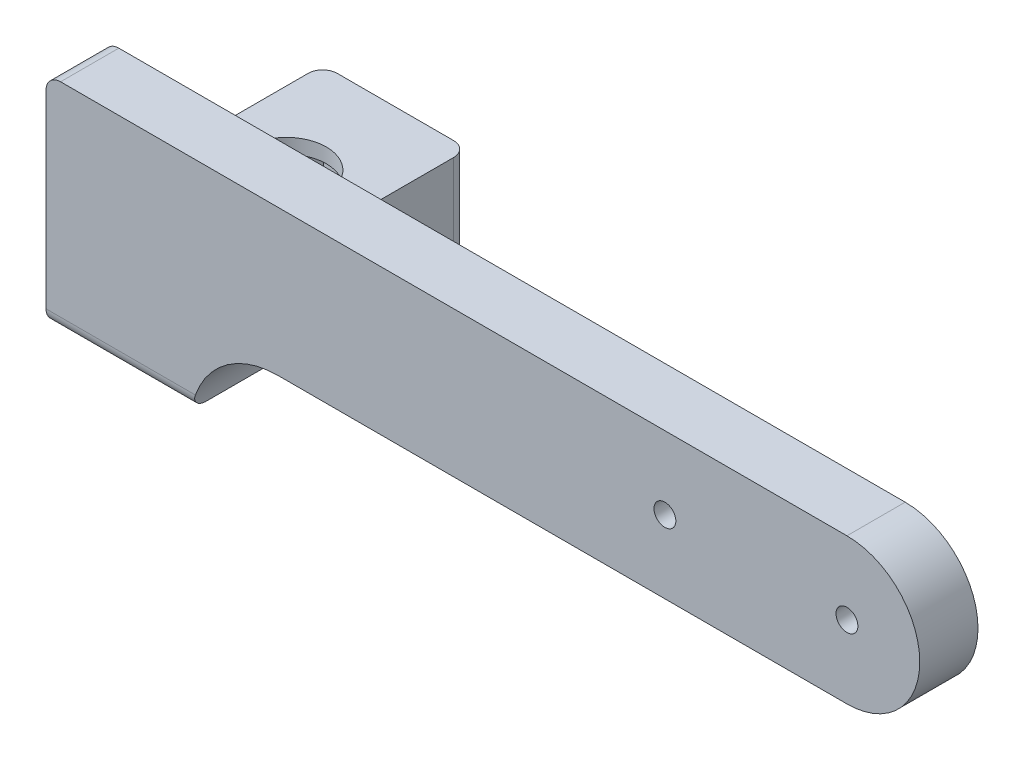
ISO-10303-21;
HEADER;
FILE_DESCRIPTION(('STEP AP214'),'2;1');
FILE_NAME('part.step','',(''),(''),'','','');
FILE_SCHEMA(('AUTOMOTIVE_DESIGN { 1 0 10303 214 1 1 1 1 }'));
ENDSEC;
DATA;
#1=APPLICATION_CONTEXT('core data for automotive mechanical design processes');
#2=APPLICATION_PROTOCOL_DEFINITION('international standard','automotive_design',2000,#1);
#3=PRODUCT_CONTEXT('',#1,'mechanical');
#4=PRODUCT('Part','Part','',(#3));
#5=PRODUCT_RELATED_PRODUCT_CATEGORY('part','',(#4));
#6=PRODUCT_DEFINITION_FORMATION('','',#4);
#7=PRODUCT_DEFINITION_CONTEXT('part definition',#1,'design');
#8=PRODUCT_DEFINITION('design','',#6,#7);
#9=PRODUCT_DEFINITION_SHAPE('','',#8);
#10=(LENGTH_UNIT() NAMED_UNIT(*) SI_UNIT(.MILLI.,.METRE.));
#11=(NAMED_UNIT(*) PLANE_ANGLE_UNIT() SI_UNIT($,.RADIAN.));
#12=(NAMED_UNIT(*) SI_UNIT($,.STERADIAN.) SOLID_ANGLE_UNIT());
#13=UNCERTAINTY_MEASURE_WITH_UNIT(LENGTH_MEASURE(1.E-05),#10,'distance_accuracy_value','');
#14=(GEOMETRIC_REPRESENTATION_CONTEXT(3) GLOBAL_UNCERTAINTY_ASSIGNED_CONTEXT((#13)) GLOBAL_UNIT_ASSIGNED_CONTEXT((#10,
#11,#12)) REPRESENTATION_CONTEXT('',''));
#15=CARTESIAN_POINT('',(0.,0.,0.));
#16=DIRECTION('',(0.,0.,1.));
#17=DIRECTION('',(1.,0.,0.));
#18=AXIS2_PLACEMENT_3D('',#15,#16,#17);
#19=CARTESIAN_POINT('',(85.,0.,0.));
#20=DIRECTION('',(0.,0.,1.));
#21=DIRECTION('',(1.,0.,0.));
#22=AXIS2_PLACEMENT_3D('',#19,#20,#21);
#23=PLANE('',#22);
#24=CARTESIAN_POINT('',(59.9999999999999,0.,0.));
#25=DIRECTION('',(0.,0.,1.));
#26=DIRECTION('',(1.,0.,0.));
#27=AXIS2_PLACEMENT_3D('',#24,#25,#26);
#28=CIRCLE('',#27,1.50000000000001);
#29=CARTESIAN_POINT('',(61.5,0.,0.));
#30=VERTEX_POINT('',#29);
#31=EDGE_CURVE('E441',#30,#30,#28,.T.);
#32=ORIENTED_EDGE('',*,*,#31,.T.);
#33=EDGE_LOOP('',(#32));
#34=FACE_BOUND('',#33,.T.);
#35=CARTESIAN_POINT('',(85.,0.,0.));
#36=DIRECTION('',(0.,0.,1.));
#37=DIRECTION('',(1.,0.,0.));
#38=AXIS2_PLACEMENT_3D('',#35,#36,#37);
#39=CIRCLE('',#38,1.5);
#40=CARTESIAN_POINT('',(86.5,0.,0.));
#41=VERTEX_POINT('',#40);
#42=EDGE_CURVE('E251',#41,#41,#39,.T.);
#43=ORIENTED_EDGE('',*,*,#42,.T.);
#44=EDGE_LOOP('',(#43));
#45=FACE_BOUND('',#44,.T.);
#46=DIRECTION('',(0.,-1.,0.));
#47=VECTOR('',#46,1.);
#48=CARTESIAN_POINT('',(-25.,10.,0.));
#49=LINE('',#48,#47);
#50=CARTESIAN_POINT('',(-25.,8.,0.));
#51=VERTEX_POINT('',#50);
#52=CARTESIAN_POINT('',(-25.,-3.,0.));
#53=VERTEX_POINT('',#52);
#54=EDGE_CURVE('E264',#51,#53,#49,.T.);
#55=ORIENTED_EDGE('',*,*,#54,.F.);
#56=CARTESIAN_POINT('',(-23.,8.,0.));
#57=DIRECTION('',(0.,0.,1.));
#58=DIRECTION('',(1.,0.,0.));
#59=AXIS2_PLACEMENT_3D('',#56,#57,#58);
#60=CIRCLE('',#59,2.);
#61=CARTESIAN_POINT('',(-23.,10.,0.));
#62=VERTEX_POINT('',#61);
#63=EDGE_CURVE('E336',#51,#62,#60,.F.);
#64=ORIENTED_EDGE('',*,*,#63,.T.);
#65=DIRECTION('',(-1.,0.,0.));
#66=VECTOR('',#65,1.);
#67=CARTESIAN_POINT('',(-25.,10.,0.));
#68=LINE('',#67,#66);
#69=CARTESIAN_POINT('',(85.,10.,0.));
#70=VERTEX_POINT('',#69);
#71=EDGE_CURVE('E256',#70,#62,#68,.T.);
#72=ORIENTED_EDGE('',*,*,#71,.F.);
#73=CARTESIAN_POINT('',(85.,0.,0.));
#74=DIRECTION('',(0.,0.,1.));
#75=DIRECTION('',(1.,0.,0.));
#76=AXIS2_PLACEMENT_3D('',#73,#74,#75);
#77=CIRCLE('',#76,10.);
#78=CARTESIAN_POINT('',(85.,-10.,0.));
#79=VERTEX_POINT('',#78);
#80=EDGE_CURVE('E268',#79,#70,#77,.T.);
#81=ORIENTED_EDGE('',*,*,#80,.F.);
#82=DIRECTION('',(1.,0.,0.));
#83=VECTOR('',#82,1.);
#84=CARTESIAN_POINT('',(-25.,-10.,0.));
#85=LINE('',#84,#83);
#86=CARTESIAN_POINT('',(6.83215956619923,-10.,0.));
#87=VERTEX_POINT('',#86);
#88=EDGE_CURVE('E266',#87,#79,#85,.T.);
#89=ORIENTED_EDGE('',*,*,#88,.F.);
#90=CARTESIAN_POINT('',(6.83215956619924,-22.,0.));
#91=DIRECTION('',(0.,0.,1.));
#92=DIRECTION('',(1.,0.,0.));
#93=AXIS2_PLACEMENT_3D('',#90,#91,#92);
#94=CIRCLE('',#93,12.);
#95=CARTESIAN_POINT('',(0.,-12.1348291620473,0.));
#96=VERTEX_POINT('',#95);
#97=EDGE_CURVE('E282',#87,#96,#94,.T.);
#98=ORIENTED_EDGE('',*,*,#97,.T.);
#99=DIRECTION('',(0.,-1.,0.));
#100=VECTOR('',#99,1.);
#101=CARTESIAN_POINT('',(0.,0.,0.));
#102=LINE('',#101,#100);
#103=CARTESIAN_POINT('',(0.,-3.,0.));
#104=VERTEX_POINT('',#103);
#105=EDGE_CURVE('E295',#96,#104,#102,.F.);
#106=ORIENTED_EDGE('',*,*,#105,.T.);
#107=DIRECTION('',(1.,0.,0.));
#108=VECTOR('',#107,1.);
#109=CARTESIAN_POINT('',(-25.,-3.,0.));
#110=LINE('',#109,#108);
#111=EDGE_CURVE('E292',#104,#53,#110,.F.);
#112=ORIENTED_EDGE('',*,*,#111,.T.);
#113=EDGE_LOOP('',(#55,#64,#72,#81,#89,#98,#106,#112));
#114=FACE_BOUND('',#113,.T.);
#115=ADVANCED_FACE('F32',(#34,#45,#114),#23,.F.);
#116=CARTESIAN_POINT('',(-25.,10.,8.));
#117=DIRECTION('',(1.,0.,0.));
#118=DIRECTION('',(0.,1.,0.));
#119=AXIS2_PLACEMENT_3D('',#116,#117,#118);
#120=PLANE('',#119);
#121=DIRECTION('',(0.,0.,-1.));
#122=VECTOR('',#121,1.);
#123=CARTESIAN_POINT('',(-25.,-20.,8.));
#124=LINE('',#123,#122);
#125=CARTESIAN_POINT('',(-25.,-20.,6.));
#126=VERTEX_POINT('',#125);
#127=CARTESIAN_POINT('',(-25.,-20.,-28.));
#128=VERTEX_POINT('',#127);
#129=EDGE_CURVE('E243',#126,#128,#124,.T.);
#130=ORIENTED_EDGE('',*,*,#129,.F.);
#131=CARTESIAN_POINT('',(-25.,-18.,6.));
#132=DIRECTION('',(1.,0.,0.));
#133=DIRECTION('',(0.,1.,0.));
#134=AXIS2_PLACEMENT_3D('',#131,#132,#133);
#135=CIRCLE('',#134,2.);
#136=CARTESIAN_POINT('',(-25.,-18.,8.));
#137=VERTEX_POINT('',#136);
#138=EDGE_CURVE('E364',#126,#137,#135,.F.);
#139=ORIENTED_EDGE('',*,*,#138,.T.);
#140=DIRECTION('',(0.,-1.,0.));
#141=VECTOR('',#140,1.);
#142=CARTESIAN_POINT('',(-25.,10.,8.));
#143=LINE('',#142,#141);
#144=CARTESIAN_POINT('',(-25.,8.,8.));
#145=VERTEX_POINT('',#144);
#146=EDGE_CURVE('E252',#145,#137,#143,.T.);
#147=ORIENTED_EDGE('',*,*,#146,.F.);
#148=DIRECTION('',(0.,0.,-1.));
#149=VECTOR('',#148,1.);
#150=CARTESIAN_POINT('',(-25.,8.,8.));
#151=LINE('',#150,#149);
#152=EDGE_CURVE('E360',#145,#51,#151,.T.);
#153=ORIENTED_EDGE('',*,*,#152,.T.);
#154=ORIENTED_EDGE('',*,*,#54,.T.);
#155=CARTESIAN_POINT('',(-25.,-3.,-5.));
#156=DIRECTION('',(1.,0.,0.));
#157=DIRECTION('',(0.,1.,0.));
#158=AXIS2_PLACEMENT_3D('',#155,#156,#157);
#159=CIRCLE('',#158,5.);
#160=CARTESIAN_POINT('',(-25.,-8.,-5.));
#161=VERTEX_POINT('',#160);
#162=EDGE_CURVE('E307',#53,#161,#159,.T.);
#163=ORIENTED_EDGE('',*,*,#162,.T.);
#164=DIRECTION('',(0.,0.,1.));
#165=VECTOR('',#164,1.);
#166=CARTESIAN_POINT('',(-25.,-8.,-30.));
#167=LINE('',#166,#165);
#168=CARTESIAN_POINT('',(-25.,-8.,-28.));
#169=VERTEX_POINT('',#168);
#170=EDGE_CURVE('E237',#169,#161,#167,.T.);
#171=ORIENTED_EDGE('',*,*,#170,.F.);
#172=DIRECTION('',(0.,1.,0.));
#173=VECTOR('',#172,1.);
#174=CARTESIAN_POINT('',(-25.,10.,-28.));
#175=LINE('',#174,#173);
#176=EDGE_CURVE('E355',#169,#128,#175,.F.);
#177=ORIENTED_EDGE('',*,*,#176,.T.);
#178=EDGE_LOOP('',(#130,#139,#147,#153,#154,#163,#171,#177));
#179=FACE_BOUND('',#178,.T.);
#180=ADVANCED_FACE('F354',(#179),#120,.F.);
#181=CARTESIAN_POINT('',(-25.,-10.,8.));
#182=DIRECTION('',(0.,1.,0.));
#183=DIRECTION('',(0.,0.,1.));
#184=AXIS2_PLACEMENT_3D('',#181,#182,#183);
#185=PLANE('',#184);
#186=DIRECTION('',(1.,0.,0.));
#187=VECTOR('',#186,1.);
#188=CARTESIAN_POINT('',(-25.,-10.,8.));
#189=LINE('',#188,#187);
#190=CARTESIAN_POINT('',(6.83215956619923,-10.,8.));
#191=VERTEX_POINT('',#190);
#192=CARTESIAN_POINT('',(85.,-10.,8.));
#193=VERTEX_POINT('',#192);
#194=EDGE_CURVE('E255',#191,#193,#189,.T.);
#195=ORIENTED_EDGE('',*,*,#194,.F.);
#196=DIRECTION('',(0.,0.,-1.));
#197=VECTOR('',#196,1.);
#198=CARTESIAN_POINT('',(6.83215956619923,-10.,8.));
#199=LINE('',#198,#197);
#200=EDGE_CURVE('E277',#191,#87,#199,.T.);
#201=ORIENTED_EDGE('',*,*,#200,.T.);
#202=ORIENTED_EDGE('',*,*,#88,.T.);
#203=DIRECTION('',(0.,0.,-1.));
#204=VECTOR('',#203,1.);
#205=CARTESIAN_POINT('',(85.,-10.,8.));
#206=LINE('',#205,#204);
#207=EDGE_CURVE('E274',#193,#79,#206,.T.);
#208=ORIENTED_EDGE('',*,*,#207,.F.);
#209=EDGE_LOOP('',(#195,#201,#202,#208));
#210=FACE_BOUND('',#209,.T.);
#211=ADVANCED_FACE('F405',(#210),#185,.F.);
#212=CARTESIAN_POINT('',(85.,0.,8.));
#213=DIRECTION('',(0.,0.,-1.));
#214=DIRECTION('',(-1.,0.,0.));
#215=AXIS2_PLACEMENT_3D('',#212,#213,#214);
#216=CYLINDRICAL_SURFACE('',#215,10.);
#217=ORIENTED_EDGE('',*,*,#80,.T.);
#218=DIRECTION('',(0.,0.,-1.));
#219=VECTOR('',#218,1.);
#220=CARTESIAN_POINT('',(85.,10.,8.));
#221=LINE('',#220,#219);
#222=CARTESIAN_POINT('',(85.,10.,8.));
#223=VERTEX_POINT('',#222);
#224=EDGE_CURVE('E263',#223,#70,#221,.T.);
#225=ORIENTED_EDGE('',*,*,#224,.F.);
#226=CARTESIAN_POINT('',(85.,0.,8.));
#227=DIRECTION('',(0.,0.,1.));
#228=DIRECTION('',(1.,0.,0.));
#229=AXIS2_PLACEMENT_3D('',#226,#227,#228);
#230=CIRCLE('',#229,10.);
#231=EDGE_CURVE('E258',#193,#223,#230,.T.);
#232=ORIENTED_EDGE('',*,*,#231,.F.);
#233=ORIENTED_EDGE('',*,*,#207,.T.);
#234=EDGE_LOOP('',(#217,#225,#232,#233));
#235=FACE_BOUND('',#234,.T.);
#236=ADVANCED_FACE('F400',(#235),#216,.T.);
#237=CARTESIAN_POINT('',(-25.,10.,8.));
#238=DIRECTION('',(0.,-1.,0.));
#239=DIRECTION('',(0.,0.,-1.));
#240=AXIS2_PLACEMENT_3D('',#237,#238,#239);
#241=PLANE('',#240);
#242=ORIENTED_EDGE('',*,*,#71,.T.);
#243=DIRECTION('',(0.,0.,-1.));
#244=VECTOR('',#243,1.);
#245=CARTESIAN_POINT('',(-23.,10.,8.));
#246=LINE('',#245,#244);
#247=CARTESIAN_POINT('',(-23.,10.,8.));
#248=VERTEX_POINT('',#247);
#249=EDGE_CURVE('E340',#62,#248,#246,.F.);
#250=ORIENTED_EDGE('',*,*,#249,.T.);
#251=DIRECTION('',(-1.,0.,0.));
#252=VECTOR('',#251,1.);
#253=CARTESIAN_POINT('',(-25.,10.,8.));
#254=LINE('',#253,#252);
#255=EDGE_CURVE('E260',#223,#248,#254,.T.);
#256=ORIENTED_EDGE('',*,*,#255,.F.);
#257=ORIENTED_EDGE('',*,*,#224,.T.);
#258=EDGE_LOOP('',(#242,#250,#256,#257));
#259=FACE_BOUND('',#258,.T.);
#260=ADVANCED_FACE('F395',(#259),#241,.F.);
#261=CARTESIAN_POINT('',(85.,0.,8.));
#262=DIRECTION('',(0.,0.,1.));
#263=DIRECTION('',(1.,0.,0.));
#264=AXIS2_PLACEMENT_3D('',#261,#262,#263);
#265=PLANE('',#264);
#266=CARTESIAN_POINT('',(59.9999999999999,0.,8.));
#267=DIRECTION('',(0.,0.,1.));
#268=DIRECTION('',(1.,0.,0.));
#269=AXIS2_PLACEMENT_3D('',#266,#267,#268);
#270=CIRCLE('',#269,1.50000000000001);
#271=CARTESIAN_POINT('',(61.5,0.,8.));
#272=VERTEX_POINT('',#271);
#273=EDGE_CURVE('E436',#272,#272,#270,.T.);
#274=ORIENTED_EDGE('',*,*,#273,.F.);
#275=EDGE_LOOP('',(#274));
#276=FACE_BOUND('',#275,.T.);
#277=CARTESIAN_POINT('',(85.,0.,8.));
#278=DIRECTION('',(0.,0.,1.));
#279=DIRECTION('',(1.,0.,0.));
#280=AXIS2_PLACEMENT_3D('',#277,#278,#279);
#281=CIRCLE('',#280,1.5);
#282=CARTESIAN_POINT('',(86.5,0.,8.));
#283=VERTEX_POINT('',#282);
#284=EDGE_CURVE('E246',#283,#283,#281,.T.);
#285=ORIENTED_EDGE('',*,*,#284,.F.);
#286=EDGE_LOOP('',(#285));
#287=FACE_BOUND('',#286,.T.);
#288=ORIENTED_EDGE('',*,*,#146,.T.);
#289=DIRECTION('',(-1.,0.,0.));
#290=VECTOR('',#289,1.);
#291=CARTESIAN_POINT('',(85.,-18.,8.));
#292=LINE('',#291,#290);
#293=CARTESIAN_POINT('',(-4.48154893278553,-18.,8.));
#294=VERTEX_POINT('',#293);
#295=EDGE_CURVE('E337',#137,#294,#292,.F.);
#296=ORIENTED_EDGE('',*,*,#295,.T.);
#297=CARTESIAN_POINT('',(6.83215956619924,-22.,8.));
#298=DIRECTION('',(0.,0.,1.));
#299=DIRECTION('',(1.,0.,0.));
#300=AXIS2_PLACEMENT_3D('',#297,#298,#299);
#301=CIRCLE('',#300,12.);
#302=EDGE_CURVE('E285',#294,#191,#301,.F.);
#303=ORIENTED_EDGE('',*,*,#302,.T.);
#304=ORIENTED_EDGE('',*,*,#194,.T.);
#305=ORIENTED_EDGE('',*,*,#231,.T.);
#306=ORIENTED_EDGE('',*,*,#255,.T.);
#307=CARTESIAN_POINT('',(-23.,8.,8.));
#308=DIRECTION('',(0.,0.,1.));
#309=DIRECTION('',(1.,0.,0.));
#310=AXIS2_PLACEMENT_3D('',#307,#308,#309);
#311=CIRCLE('',#310,2.);
#312=EDGE_CURVE('E371',#248,#145,#311,.T.);
#313=ORIENTED_EDGE('',*,*,#312,.T.);
#314=EDGE_LOOP('',(#288,#296,#303,#304,#305,#306,#313));
#315=FACE_BOUND('',#314,.T.);
#316=ADVANCED_FACE('F377',(#276,#287,#315),#265,.T.);
#317=CARTESIAN_POINT('',(85.,0.,-2.));
#318=DIRECTION('',(0.,0.,1.));
#319=DIRECTION('',(1.,0.,0.));
#320=AXIS2_PLACEMENT_3D('',#317,#318,#319);
#321=CYLINDRICAL_SURFACE('',#320,1.5);
#322=ORIENTED_EDGE('',*,*,#284,.T.);
#323=EDGE_LOOP('',(#322));
#324=FACE_BOUND('',#323,.T.);
#325=ORIENTED_EDGE('',*,*,#42,.F.);
#326=EDGE_LOOP('',(#325));
#327=FACE_BOUND('',#326,.T.);
#328=ADVANCED_FACE('F427',(#324,#327),#321,.F.);
#329=CARTESIAN_POINT('',(-25.,-20.,8.));
#330=DIRECTION('',(0.,-1.,0.));
#331=DIRECTION('',(1.,0.,0.));
#332=AXIS2_PLACEMENT_3D('',#329,#330,#331);
#333=PLANE('',#332);
#334=DIRECTION('',(-0.642787609686542,0.,0.766044443118976));
#335=VECTOR('',#334,1.);
#336=CARTESIAN_POINT('',(-6.62913409939624,-20.,-13.5239904898311));
#337=LINE('',#336,#335);
#338=CARTESIAN_POINT('',(-6.62913409939624,-20.,-13.5239904898311));
#339=VERTEX_POINT('',#338);
#340=CARTESIAN_POINT('',(-12.0928287817318,-20.,-7.01261272331977));
#341=VERTEX_POINT('',#340);
#342=EDGE_CURVE('E177',#339,#341,#337,.T.);
#343=ORIENTED_EDGE('',*,*,#342,.F.);
#344=DIRECTION('',(0.342020143325665,0.,0.93969262078591));
#345=VECTOR('',#344,1.);
#346=CARTESIAN_POINT('',(-9.5363053176644,-20.,-21.5113777665113));
#347=LINE('',#346,#345);
#348=CARTESIAN_POINT('',(-9.5363053176644,-20.,-21.5113777665113));
#349=VERTEX_POINT('',#348);
#350=EDGE_CURVE('E195',#349,#339,#347,.T.);
#351=ORIENTED_EDGE('',*,*,#350,.F.);
#352=DIRECTION('',(0.984807753012208,0.,0.173648177666933));
#353=VECTOR('',#352,1.);
#354=CARTESIAN_POINT('',(-17.9071712182682,-20.,-22.9873872766802));
#355=LINE('',#354,#353);
#356=CARTESIAN_POINT('',(-17.9071712182682,-20.,-22.9873872766802));
#357=VERTEX_POINT('',#356);
#358=EDGE_CURVE('E198',#357,#349,#355,.T.);
#359=ORIENTED_EDGE('',*,*,#358,.F.);
#360=DIRECTION('',(0.642787609686542,0.,-0.766044443118976));
#361=VECTOR('',#360,1.);
#362=CARTESIAN_POINT('',(-23.3708659006038,-20.,-16.4760095101689));
#363=LINE('',#362,#361);
#364=CARTESIAN_POINT('',(-23.3708659006038,-20.,-16.4760095101689));
#365=VERTEX_POINT('',#364);
#366=EDGE_CURVE('E218',#365,#357,#363,.T.);
#367=ORIENTED_EDGE('',*,*,#366,.F.);
#368=DIRECTION('',(-0.342020143325665,0.,-0.939692620785909));
#369=VECTOR('',#368,1.);
#370=CARTESIAN_POINT('',(-20.4636946823356,-20.,-8.4886222334887));
#371=LINE('',#370,#369);
#372=CARTESIAN_POINT('',(-20.4636946823356,-20.,-8.4886222334887));
#373=VERTEX_POINT('',#372);
#374=EDGE_CURVE('E215',#373,#365,#371,.T.);
#375=ORIENTED_EDGE('',*,*,#374,.F.);
#376=DIRECTION('',(-0.984807753012207,0.,-0.173648177666934));
#377=VECTOR('',#376,1.);
#378=CARTESIAN_POINT('',(-12.0928287817318,-20.,-7.01261272331977));
#379=LINE('',#378,#377);
#380=EDGE_CURVE('E212',#341,#373,#379,.T.);
#381=ORIENTED_EDGE('',*,*,#380,.F.);
#382=EDGE_LOOP('',(#343,#351,#359,#367,#375,#381));
#383=FACE_BOUND('',#382,.T.);
#384=DIRECTION('',(0.,0.,-1.));
#385=VECTOR('',#384,1.);
#386=CARTESIAN_POINT('',(-5.,-20.,8.));
#387=LINE('',#386,#385);
#388=CARTESIAN_POINT('',(-5.,-20.,6.));
#389=VERTEX_POINT('',#388);
#390=CARTESIAN_POINT('',(-5.,-20.,-5.));
#391=VERTEX_POINT('',#390);
#392=EDGE_CURVE('E247',#389,#391,#387,.T.);
#393=ORIENTED_EDGE('',*,*,#392,.F.);
#394=DIRECTION('',(-1.,0.,0.));
#395=VECTOR('',#394,1.);
#396=CARTESIAN_POINT('',(-25.,-20.,6.));
#397=LINE('',#396,#395);
#398=EDGE_CURVE('E361',#389,#126,#397,.T.);
#399=ORIENTED_EDGE('',*,*,#398,.T.);
#400=ORIENTED_EDGE('',*,*,#129,.T.);
#401=CARTESIAN_POINT('',(-23.,-20.,-28.));
#402=DIRECTION('',(0.,-1.,0.));
#403=DIRECTION('',(1.,0.,0.));
#404=AXIS2_PLACEMENT_3D('',#401,#402,#403);
#405=CIRCLE('',#404,2.);
#406=CARTESIAN_POINT('',(-23.,-20.,-30.));
#407=VERTEX_POINT('',#406);
#408=EDGE_CURVE('E359',#128,#407,#405,.T.);
#409=ORIENTED_EDGE('',*,*,#408,.T.);
#410=DIRECTION('',(-1.,0.,0.));
#411=VECTOR('',#410,1.);
#412=CARTESIAN_POINT('',(-25.,-20.,-30.));
#413=LINE('',#412,#411);
#414=CARTESIAN_POINT('',(-7.,-20.,-30.));
#415=VERTEX_POINT('',#414);
#416=EDGE_CURVE('E239',#415,#407,#413,.T.);
#417=ORIENTED_EDGE('',*,*,#416,.F.);
#418=CARTESIAN_POINT('',(-7.,-20.,-28.));
#419=DIRECTION('',(0.,-1.,0.));
#420=DIRECTION('',(1.,0.,0.));
#421=AXIS2_PLACEMENT_3D('',#418,#419,#420);
#422=CIRCLE('',#421,2.);
#423=CARTESIAN_POINT('',(-5.,-20.,-28.));
#424=VERTEX_POINT('',#423);
#425=EDGE_CURVE('E367',#415,#424,#422,.T.);
#426=ORIENTED_EDGE('',*,*,#425,.T.);
#427=EDGE_CURVE('E242',#391,#424,#387,.T.);
#428=ORIENTED_EDGE('',*,*,#427,.F.);
#429=EDGE_LOOP('',(#393,#399,#400,#409,#417,#426,#428));
#430=FACE_BOUND('',#429,.T.);
#431=ADVANCED_FACE('F385',(#383,#430),#333,.T.);
#432=CARTESIAN_POINT('',(-5.,-10.,8.));
#433=DIRECTION('',(1.,0.,0.));
#434=DIRECTION('',(0.,0.,-1.));
#435=AXIS2_PLACEMENT_3D('',#432,#433,#434);
#436=PLANE('',#435);
#437=ORIENTED_EDGE('',*,*,#427,.T.);
#438=DIRECTION('',(0.,-1.,0.));
#439=VECTOR('',#438,1.);
#440=CARTESIAN_POINT('',(-5.,-8.,-28.));
#441=LINE('',#440,#439);
#442=CARTESIAN_POINT('',(-5.,-8.,-28.));
#443=VERTEX_POINT('',#442);
#444=EDGE_CURVE('E47',#424,#443,#441,.F.);
#445=ORIENTED_EDGE('',*,*,#444,.T.);
#446=DIRECTION('',(0.,0.,-1.));
#447=VECTOR('',#446,1.);
#448=CARTESIAN_POINT('',(-5.,-8.,-30.));
#449=LINE('',#448,#447);
#450=CARTESIAN_POINT('',(-5.,-8.,-5.));
#451=VERTEX_POINT('',#450);
#452=EDGE_CURVE('E225',#451,#443,#449,.T.);
#453=ORIENTED_EDGE('',*,*,#452,.F.);
#454=DIRECTION('',(0.,-1.,0.));
#455=VECTOR('',#454,1.);
#456=CARTESIAN_POINT('',(-5.,-10.,-5.));
#457=LINE('',#456,#455);
#458=EDGE_CURVE('E287',#451,#391,#457,.T.);
#459=ORIENTED_EDGE('',*,*,#458,.T.);
#460=EDGE_LOOP('',(#437,#445,#453,#459));
#461=FACE_BOUND('',#460,.T.);
#462=ADVANCED_FACE('F453',(#461),#436,.T.);
#463=CARTESIAN_POINT('',(0.,0.,-30.));
#464=DIRECTION('',(0.,0.,1.));
#465=DIRECTION('',(1.,0.,0.));
#466=AXIS2_PLACEMENT_3D('',#463,#464,#465);
#467=PLANE('',#466);
#468=DIRECTION('',(-1.,0.,0.));
#469=VECTOR('',#468,1.);
#470=CARTESIAN_POINT('',(-5.,-8.,-30.));
#471=LINE('',#470,#469);
#472=CARTESIAN_POINT('',(-7.,-8.,-30.));
#473=VERTEX_POINT('',#472);
#474=CARTESIAN_POINT('',(-23.,-8.,-30.));
#475=VERTEX_POINT('',#474);
#476=EDGE_CURVE('E234',#473,#475,#471,.T.);
#477=ORIENTED_EDGE('',*,*,#476,.F.);
#478=DIRECTION('',(0.,-1.,0.));
#479=VECTOR('',#478,1.);
#480=CARTESIAN_POINT('',(-7.,-20.,-30.));
#481=LINE('',#480,#479);
#482=EDGE_CURVE('E344',#473,#415,#481,.T.);
#483=ORIENTED_EDGE('',*,*,#482,.T.);
#484=ORIENTED_EDGE('',*,*,#416,.T.);
#485=DIRECTION('',(0.,1.,0.));
#486=VECTOR('',#485,1.);
#487=CARTESIAN_POINT('',(-23.,0.,-30.));
#488=LINE('',#487,#486);
#489=EDGE_CURVE('E342',#407,#475,#488,.T.);
#490=ORIENTED_EDGE('',*,*,#489,.T.);
#491=EDGE_LOOP('',(#477,#483,#484,#490));
#492=FACE_BOUND('',#491,.T.);
#493=ADVANCED_FACE('F457',(#492),#467,.F.);
#494=CARTESIAN_POINT('',(6.83215956619924,-22.,8.));
#495=DIRECTION('',(0.,0.,-1.));
#496=DIRECTION('',(-1.,0.,0.));
#497=AXIS2_PLACEMENT_3D('',#494,#495,#496);
#498=CYLINDRICAL_SURFACE('',#497,12.);
#499=ORIENTED_EDGE('',*,*,#302,.F.);
#500=CARTESIAN_POINT('',(-4.48154893278553,-18.,8.));
#501=CARTESIAN_POINT('',(-4.50138125313948,-18.0560877717623,7.99999832305192));
#502=CARTESIAN_POINT('',(-4.52078424019849,-18.1123031979097,7.99763882394037));
#503=CARTESIAN_POINT('',(-4.55864154941412,-18.2246643135857,7.98814251719226));
#504=CARTESIAN_POINT('',(-4.57709563531679,-18.2808099823833,7.98100452596653));
#505=CARTESIAN_POINT('',(-4.63089238189496,-18.4486356009318,7.95232807713334));
#506=CARTESIAN_POINT('',(-4.66466130278686,-18.559680833343,7.92352709442766));
#507=CARTESIAN_POINT('',(-4.72735408814331,-18.7765785860345,7.84667328021879));
#508=CARTESIAN_POINT('',(-4.7562683096932,-18.8824204829235,7.79858276083968));
#509=CARTESIAN_POINT('',(-4.80888524868177,-19.0850345721453,7.68410594838005));
#510=CARTESIAN_POINT('',(-4.8325930659608,-19.1818155860983,7.61773770389394));
#511=CARTESIAN_POINT('',(-4.87405212171451,-19.3594265529934,7.47129257380848));
#512=CARTESIAN_POINT('',(-4.89199696991578,-19.4407259787916,7.39183921718088));
#513=CARTESIAN_POINT('',(-4.92339777930131,-19.5890591318635,7.21975075455985));
#514=CARTESIAN_POINT('',(-4.93685253648592,-19.6560890310796,7.12711212247243));
#515=CARTESIAN_POINT('',(-4.95935046191041,-19.772062493677,6.93390339662555));
#516=CARTESIAN_POINT('',(-4.96849692689365,-19.8214219011766,6.83359426728588));
#517=CARTESIAN_POINT('',(-4.98322858152512,-19.902781623108,6.62596324805298));
#518=CARTESIAN_POINT('',(-4.98881654519301,-19.9347954563216,6.51864689275829));
#519=CARTESIAN_POINT('',(-4.99519390458775,-19.9717226972868,6.34212747261345));
#520=CARTESIAN_POINT('',(-4.99700177862493,-19.9823210790566,6.27409656410973));
#521=CARTESIAN_POINT('',(-4.99940140648305,-19.9964577732676,6.13738714644132));
#522=CARTESIAN_POINT('',(-4.99999497922922,-20.0000066450736,6.06870976091195));
#523=CARTESIAN_POINT('',(-5.,-20.,6.));
#524=B_SPLINE_CURVE_WITH_KNOTS('',3,(#500,#501,#502,#503,#504,#505,#506,#507,#508,#509,#510,
#511,#512,#513,#514,#515,#516,#517,#518,#519,#520,#521,#522,#523),.UNSPECIFIED.,.F.,.F.,(4,2,2,
2,2,2,2,2,2,2,2,4),(0.,0.17837527524822,0.356794748790082,0.713707003854084,1.07132001712111,
1.42858115883977,1.7721376621222,2.11578621480146,2.45071320477386,2.78537878270886,
2.99165964856607,3.19763129543271),.UNSPECIFIED.);
#525=EDGE_CURVE('E329',#294,#389,#524,.T.);
#526=ORIENTED_EDGE('',*,*,#525,.T.);
#527=ORIENTED_EDGE('',*,*,#392,.T.);
#528=CARTESIAN_POINT('',(-5.,-20.,-5.));
#529=CARTESIAN_POINT('',(-5.00002983071516,-20.0002423652182,-4.94276954902935));
#530=CARTESIAN_POINT('',(-4.99901934267985,-19.9941907321539,-4.88595530761524));
#531=CARTESIAN_POINT('',(-4.99525039157633,-19.9720554020881,-4.77555185338585));
#532=CARTESIAN_POINT('',(-4.99252898286227,-19.9561844798837,-4.72192001648874));
#533=CARTESIAN_POINT('',(-4.98408791010207,-19.90785267169,-4.59418000961095));
#534=CARTESIAN_POINT('',(-4.97756841164664,-19.8711330466681,-4.52180614517529));
#535=CARTESIAN_POINT('',(-4.96223202410665,-19.7877219107002,-4.3825808930968));
#536=CARTESIAN_POINT('',(-4.95339017335325,-19.7409231136344,-4.31580059752893));
#537=CARTESIAN_POINT('',(-4.92774697062384,-19.6101574112571,-4.14638742167474));
#538=CARTESIAN_POINT('',(-4.90944657037671,-19.5213908358724,-4.04776496875074));
#539=CARTESIAN_POINT('',(-4.86890013634191,-19.336487127318,-3.85845009250445));
#540=CARTESIAN_POINT('',(-4.8466436889024,-19.2403309309494,-3.76777956580897));
#541=CARTESIAN_POINT('',(-4.79843003565541,-19.0437085450451,-3.59166124125073));
#542=CARTESIAN_POINT('',(-4.7724617061297,-18.9432300591574,-3.50623028658098));
#543=CARTESIAN_POINT('',(-4.71703917712112,-18.7400762924599,-3.33950703775577));
#544=CARTESIAN_POINT('',(-4.68758913168601,-18.6374037469055,-3.2582099738707));
#545=CARTESIAN_POINT('',(-4.61901325405676,-18.4100985902356,-3.08290445499588));
#546=CARTESIAN_POINT('',(-4.57912825037921,-18.2851624051574,-2.98958644310515));
#547=CARTESIAN_POINT('',(-4.49437716998494,-18.034255935153,-2.80666530000505));
#548=CARTESIAN_POINT('',(-4.44951033121737,-17.9082854947577,-2.71706274002012));
#549=CARTESIAN_POINT('',(-4.30730488015702,-17.5295368759611,-2.4530012696897));
#550=CARTESIAN_POINT('',(-4.2024203561827,-17.2761195498434,-2.28343795798222));
#551=CARTESIAN_POINT('',(-3.9722913836724,-16.7711556777164,-1.95686688191674));
#552=CARTESIAN_POINT('',(-3.84708080936692,-16.5196067351079,-1.79983886555038));
#553=CARTESIAN_POINT('',(-3.57558827900187,-16.0200735556958,-1.49911766184629));
#554=CARTESIAN_POINT('',(-3.4293185993765,-15.7720873339923,-1.35541678512763));
#555=CARTESIAN_POINT('',(-3.14961065204293,-15.335473435628,-1.11332897815827));
#556=CARTESIAN_POINT('',(-3.0204258322933,-15.1457864250495,-1.01192702679406));
#557=CARTESIAN_POINT('',(-2.7485294155333,-14.7706115192609,-0.819893533912961));
#558=CARTESIAN_POINT('',(-2.60581660491877,-14.5851240026428,-0.729262960349702));
#559=CARTESIAN_POINT('',(-2.30728539567637,-14.2201589955088,-0.560890363369335));
#560=CARTESIAN_POINT('',(-2.15151761366808,-14.0406617508639,-0.483101744511609));
#561=CARTESIAN_POINT('',(-1.82648848948985,-13.6882485401282,-0.342179324884258));
#562=CARTESIAN_POINT('',(-1.65723183331395,-13.5153303190805,-0.279040464390576));
#563=CARTESIAN_POINT('',(-1.36841508496078,-13.2378560430232,-0.189444479936658));
#564=CARTESIAN_POINT('',(-1.25267734182957,-13.1309270879083,-0.157938067629622));
#565=CARTESIAN_POINT('',(-1.01604778268768,-12.9208668537399,-0.102817284378438));
#566=CARTESIAN_POINT('',(-0.895157979504437,-12.8177341203861,-0.0791998626316512));
#567=CARTESIAN_POINT('',(-0.647824429568627,-12.6151449323776,-0.0405569345325324));
#568=CARTESIAN_POINT('',(-0.521353323286093,-12.5157123550073,-0.0255803859630951));
#569=CARTESIAN_POINT('',(-0.263900565394985,-12.32156759435,-0.00529847183239202));
#570=CARTESIAN_POINT('',(-0.132914578924757,-12.2268601740619,-2.6803381606355E-06));
#571=CARTESIAN_POINT('',(0.,-12.1348291620473,0.));
#572=B_SPLINE_CURVE_WITH_KNOTS('',3,(#528,#529,#530,#531,#532,#533,#534,#535,#536,#537,#538,
#539,#540,#541,#542,#543,#544,#545,#546,#547,#548,#549,#550,#551,#552,#553,#554,#555,#556,#557,
#558,#559,#560,#561,#562,#563,#564,#565,#566,#567,#568,#569,#570,#571),.UNSPECIFIED.,.F.,.F.,(4,
2,2,2,2,2,2,2,2,2,2,2,2,2,2,2,2,2,2,2,2,4),(0.,0.170703151596656,0.337830952092287,
0.580693490649767,0.826281587637511,1.22705914658555,1.62890774734898,2.03198688396057,
2.43458986869146,2.91732242315391,3.40012892122403,4.3665052326105,5.33128726545324,
6.29550913757507,7.04766010365497,7.79987860962329,8.54930476127781,9.29847169003779,
9.78026574132661,10.2618732586285,10.7461833470875,11.2309721495371),.UNSPECIFIED.);
#573=EDGE_CURVE('E299',#391,#96,#572,.T.);
#574=ORIENTED_EDGE('',*,*,#573,.T.);
#575=ORIENTED_EDGE('',*,*,#97,.F.);
#576=ORIENTED_EDGE('',*,*,#200,.F.);
#577=EDGE_LOOP('',(#499,#526,#527,#574,#575,#576));
#578=FACE_BOUND('',#577,.T.);
#579=ADVANCED_FACE('F309',(#578),#498,.F.);
#580=CARTESIAN_POINT('',(0.,-8.,0.));
#581=DIRECTION('',(0.,-1.,0.));
#582=DIRECTION('',(1.,0.,0.));
#583=AXIS2_PLACEMENT_3D('',#580,#581,#582);
#584=PLANE('',#583);
#585=CARTESIAN_POINT('',(-15.,-8.,-15.));
#586=DIRECTION('',(0.,-1.,0.));
#587=DIRECTION('',(1.,0.,0.));
#588=AXIS2_PLACEMENT_3D('',#585,#586,#587);
#589=CIRCLE('',#588,5.5);
#590=CARTESIAN_POINT('',(-9.5,-8.,-15.));
#591=VERTEX_POINT('',#590);
#592=EDGE_CURVE('E213',#591,#591,#589,.T.);
#593=ORIENTED_EDGE('',*,*,#592,.T.);
#594=EDGE_LOOP('',(#593));
#595=FACE_BOUND('',#594,.T.);
#596=ORIENTED_EDGE('',*,*,#452,.T.);
#597=CARTESIAN_POINT('',(-7.,-8.,-28.));
#598=DIRECTION('',(0.,-1.,0.));
#599=DIRECTION('',(1.,0.,0.));
#600=AXIS2_PLACEMENT_3D('',#597,#598,#599);
#601=CIRCLE('',#600,2.);
#602=EDGE_CURVE('E11',#443,#473,#601,.F.);
#603=ORIENTED_EDGE('',*,*,#602,.T.);
#604=ORIENTED_EDGE('',*,*,#476,.T.);
#605=CARTESIAN_POINT('',(-23.,-8.,-28.));
#606=DIRECTION('',(0.,-1.,0.));
#607=DIRECTION('',(1.,0.,0.));
#608=AXIS2_PLACEMENT_3D('',#605,#606,#607);
#609=CIRCLE('',#608,2.);
#610=EDGE_CURVE('E40',#475,#169,#609,.F.);
#611=ORIENTED_EDGE('',*,*,#610,.T.);
#612=ORIENTED_EDGE('',*,*,#170,.T.);
#613=DIRECTION('',(1.,0.,0.));
#614=VECTOR('',#613,1.);
#615=CARTESIAN_POINT('',(-5.,-8.,-5.));
#616=LINE('',#615,#614);
#617=EDGE_CURVE('E297',#161,#451,#616,.T.);
#618=ORIENTED_EDGE('',*,*,#617,.T.);
#619=EDGE_LOOP('',(#596,#603,#604,#611,#612,#618));
#620=FACE_BOUND('',#619,.T.);
#621=ADVANCED_FACE('F349',(#595,#620),#584,.F.);
#622=CARTESIAN_POINT('',(-6.62913409939624,-10.,-13.5239904898311));
#623=DIRECTION('',(0.766044443118976,0.,0.642787609686542));
#624=DIRECTION('',(0.642787609686542,0.,-0.766044443118976));
#625=AXIS2_PLACEMENT_3D('',#622,#623,#624);
#626=PLANE('',#625);
#627=ORIENTED_EDGE('',*,*,#342,.T.);
#628=DIRECTION('',(0.,-1.,0.));
#629=VECTOR('',#628,1.);
#630=CARTESIAN_POINT('',(-12.0928287817318,-10.,-7.01261272331977));
#631=LINE('',#630,#629);
#632=CARTESIAN_POINT('',(-12.0928287817318,-10.,-7.01261272331977));
#633=VERTEX_POINT('',#632);
#634=EDGE_CURVE('E170',#633,#341,#631,.T.);
#635=ORIENTED_EDGE('',*,*,#634,.F.);
#636=DIRECTION('',(-0.642787609686542,0.,0.766044443118976));
#637=VECTOR('',#636,1.);
#638=CARTESIAN_POINT('',(-6.62913409939624,-10.,-13.5239904898311));
#639=LINE('',#638,#637);
#640=CARTESIAN_POINT('',(-6.62913409939624,-10.,-13.5239904898311));
#641=VERTEX_POINT('',#640);
#642=EDGE_CURVE('E174',#641,#633,#639,.T.);
#643=ORIENTED_EDGE('',*,*,#642,.F.);
#644=DIRECTION('',(0.,-1.,0.));
#645=VECTOR('',#644,1.);
#646=CARTESIAN_POINT('',(-6.62913409939624,-10.,-13.5239904898311));
#647=LINE('',#646,#645);
#648=EDGE_CURVE('E223',#641,#339,#647,.T.);
#649=ORIENTED_EDGE('',*,*,#648,.T.);
#650=EDGE_LOOP('',(#627,#635,#643,#649));
#651=FACE_BOUND('',#650,.T.);
#652=ADVANCED_FACE('F172',(#651),#626,.F.);
#653=CARTESIAN_POINT('',(-9.53630531766439,-10.,-21.5113777665113));
#654=DIRECTION('',(0.93969262078591,0.,-0.342020143325665));
#655=DIRECTION('',(-0.342020143325665,0.,-0.93969262078591));
#656=AXIS2_PLACEMENT_3D('',#653,#654,#655);
#657=PLANE('',#656);
#658=ORIENTED_EDGE('',*,*,#350,.T.);
#659=ORIENTED_EDGE('',*,*,#648,.F.);
#660=DIRECTION('',(0.342020143325665,0.,0.93969262078591));
#661=VECTOR('',#660,1.);
#662=CARTESIAN_POINT('',(-9.53630531766439,-10.,-21.5113777665113));
#663=LINE('',#662,#661);
#664=CARTESIAN_POINT('',(-9.53630531766439,-10.,-21.5113777665113));
#665=VERTEX_POINT('',#664);
#666=EDGE_CURVE('E182',#665,#641,#663,.T.);
#667=ORIENTED_EDGE('',*,*,#666,.F.);
#668=DIRECTION('',(0.,-1.,0.));
#669=VECTOR('',#668,1.);
#670=CARTESIAN_POINT('',(-9.53630531766439,-10.,-21.5113777665113));
#671=LINE('',#670,#669);
#672=EDGE_CURVE('E226',#665,#349,#671,.T.);
#673=ORIENTED_EDGE('',*,*,#672,.T.);
#674=EDGE_LOOP('',(#658,#659,#667,#673));
#675=FACE_BOUND('',#674,.T.);
#676=ADVANCED_FACE('F485',(#675),#657,.F.);
#677=CARTESIAN_POINT('',(-17.9071712182682,-10.,-22.9873872766802));
#678=DIRECTION('',(0.173648177666933,0.,-0.984807753012208));
#679=DIRECTION('',(-0.984807753012208,0.,-0.173648177666933));
#680=AXIS2_PLACEMENT_3D('',#677,#678,#679);
#681=PLANE('',#680);
#682=ORIENTED_EDGE('',*,*,#358,.T.);
#683=ORIENTED_EDGE('',*,*,#672,.F.);
#684=DIRECTION('',(0.984807753012208,0.,0.173648177666933));
#685=VECTOR('',#684,1.);
#686=CARTESIAN_POINT('',(-17.9071712182682,-10.,-22.9873872766802));
#687=LINE('',#686,#685);
#688=CARTESIAN_POINT('',(-17.9071712182682,-10.,-22.9873872766802));
#689=VERTEX_POINT('',#688);
#690=EDGE_CURVE('E208',#689,#665,#687,.T.);
#691=ORIENTED_EDGE('',*,*,#690,.F.);
#692=DIRECTION('',(0.,-1.,0.));
#693=VECTOR('',#692,1.);
#694=CARTESIAN_POINT('',(-17.9071712182682,-10.,-22.9873872766802));
#695=LINE('',#694,#693);
#696=EDGE_CURVE('E228',#689,#357,#695,.T.);
#697=ORIENTED_EDGE('',*,*,#696,.T.);
#698=EDGE_LOOP('',(#682,#683,#691,#697));
#699=FACE_BOUND('',#698,.T.);
#700=ADVANCED_FACE('F483',(#699),#681,.F.);
#701=CARTESIAN_POINT('',(-23.3708659006038,-10.,-16.4760095101689));
#702=DIRECTION('',(-0.766044443118976,0.,-0.642787609686542));
#703=DIRECTION('',(-0.642787609686542,0.,0.766044443118976));
#704=AXIS2_PLACEMENT_3D('',#701,#702,#703);
#705=PLANE('',#704);
#706=ORIENTED_EDGE('',*,*,#366,.T.);
#707=ORIENTED_EDGE('',*,*,#696,.F.);
#708=DIRECTION('',(0.642787609686542,0.,-0.766044443118976));
#709=VECTOR('',#708,1.);
#710=CARTESIAN_POINT('',(-23.3708659006038,-10.,-16.4760095101689));
#711=LINE('',#710,#709);
#712=CARTESIAN_POINT('',(-23.3708659006038,-10.,-16.4760095101689));
#713=VERTEX_POINT('',#712);
#714=EDGE_CURVE('E205',#713,#689,#711,.T.);
#715=ORIENTED_EDGE('',*,*,#714,.F.);
#716=DIRECTION('',(0.,-1.,0.));
#717=VECTOR('',#716,1.);
#718=CARTESIAN_POINT('',(-23.3708659006038,-10.,-16.4760095101689));
#719=LINE('',#718,#717);
#720=EDGE_CURVE('E230',#713,#365,#719,.T.);
#721=ORIENTED_EDGE('',*,*,#720,.T.);
#722=EDGE_LOOP('',(#706,#707,#715,#721));
#723=FACE_BOUND('',#722,.T.);
#724=ADVANCED_FACE('F481',(#723),#705,.F.);
#725=CARTESIAN_POINT('',(-20.4636946823356,-10.,-8.4886222334887));
#726=DIRECTION('',(-0.93969262078591,0.,0.342020143325665));
#727=DIRECTION('',(0.342020143325665,0.,0.93969262078591));
#728=AXIS2_PLACEMENT_3D('',#725,#726,#727);
#729=PLANE('',#728);
#730=ORIENTED_EDGE('',*,*,#374,.T.);
#731=ORIENTED_EDGE('',*,*,#720,.F.);
#732=DIRECTION('',(-0.342020143325665,0.,-0.939692620785909));
#733=VECTOR('',#732,1.);
#734=CARTESIAN_POINT('',(-20.4636946823356,-10.,-8.4886222334887));
#735=LINE('',#734,#733);
#736=CARTESIAN_POINT('',(-20.4636946823356,-10.,-8.4886222334887));
#737=VERTEX_POINT('',#736);
#738=EDGE_CURVE('E190',#737,#713,#735,.T.);
#739=ORIENTED_EDGE('',*,*,#738,.F.);
#740=DIRECTION('',(0.,-1.,0.));
#741=VECTOR('',#740,1.);
#742=CARTESIAN_POINT('',(-20.4636946823356,-10.,-8.4886222334887));
#743=LINE('',#742,#741);
#744=EDGE_CURVE('E181',#737,#373,#743,.T.);
#745=ORIENTED_EDGE('',*,*,#744,.T.);
#746=EDGE_LOOP('',(#730,#731,#739,#745));
#747=FACE_BOUND('',#746,.T.);
#748=ADVANCED_FACE('F477',(#747),#729,.F.);
#749=CARTESIAN_POINT('',(-12.0928287817318,-10.,-7.01261272331977));
#750=DIRECTION('',(-0.173648177666934,0.,0.984807753012207));
#751=DIRECTION('',(0.984807753012207,0.,0.173648177666934));
#752=AXIS2_PLACEMENT_3D('',#749,#750,#751);
#753=PLANE('',#752);
#754=ORIENTED_EDGE('',*,*,#380,.T.);
#755=ORIENTED_EDGE('',*,*,#744,.F.);
#756=DIRECTION('',(-0.984807753012207,0.,-0.173648177666934));
#757=VECTOR('',#756,1.);
#758=CARTESIAN_POINT('',(-12.0928287817318,-10.,-7.01261272331977));
#759=LINE('',#758,#757);
#760=EDGE_CURVE('E185',#633,#737,#759,.T.);
#761=ORIENTED_EDGE('',*,*,#760,.F.);
#762=ORIENTED_EDGE('',*,*,#634,.T.);
#763=EDGE_LOOP('',(#754,#755,#761,#762));
#764=FACE_BOUND('',#763,.T.);
#765=ADVANCED_FACE('F186',(#764),#753,.F.);
#766=CARTESIAN_POINT('',(0.,-10.,0.));
#767=DIRECTION('',(0.,-1.,0.));
#768=DIRECTION('',(0.,0.,-1.));
#769=AXIS2_PLACEMENT_3D('',#766,#767,#768);
#770=PLANE('',#769);
#771=CARTESIAN_POINT('',(-15.,-10.,-15.));
#772=DIRECTION('',(0.,-1.,0.));
#773=DIRECTION('',(0.,0.,-1.));
#774=AXIS2_PLACEMENT_3D('',#771,#772,#773);
#775=CIRCLE('',#774,5.5);
#776=CARTESIAN_POINT('',(-15.,-10.,-20.5));
#777=VERTEX_POINT('',#776);
#778=EDGE_CURVE('E201',#777,#777,#775,.T.);
#779=ORIENTED_EDGE('',*,*,#778,.F.);
#780=EDGE_LOOP('',(#779));
#781=FACE_BOUND('',#780,.T.);
#782=ORIENTED_EDGE('',*,*,#642,.T.);
#783=ORIENTED_EDGE('',*,*,#760,.T.);
#784=ORIENTED_EDGE('',*,*,#738,.T.);
#785=ORIENTED_EDGE('',*,*,#714,.T.);
#786=ORIENTED_EDGE('',*,*,#690,.T.);
#787=ORIENTED_EDGE('',*,*,#666,.T.);
#788=EDGE_LOOP('',(#782,#783,#784,#785,#786,#787));
#789=FACE_BOUND('',#788,.T.);
#790=ADVANCED_FACE('F192',(#781,#789),#770,.T.);
#791=CARTESIAN_POINT('',(-15.,0.,-15.));
#792=DIRECTION('',(0.,-1.,0.));
#793=DIRECTION('',(0.,0.,-1.));
#794=AXIS2_PLACEMENT_3D('',#791,#792,#793);
#795=CYLINDRICAL_SURFACE('',#794,5.5);
#796=ORIENTED_EDGE('',*,*,#778,.T.);
#797=EDGE_LOOP('',(#796));
#798=FACE_BOUND('',#797,.T.);
#799=ORIENTED_EDGE('',*,*,#592,.F.);
#800=EDGE_LOOP('',(#799));
#801=FACE_BOUND('',#800,.T.);
#802=ADVANCED_FACE('F321',(#798,#801),#795,.F.);
#803=CARTESIAN_POINT('',(0.,-3.,-5.));
#804=DIRECTION('',(-1.,0.,0.));
#805=DIRECTION('',(0.,-1.,0.));
#806=AXIS2_PLACEMENT_3D('',#803,#804,#805);
#807=CYLINDRICAL_SURFACE('',#806,5.);
#808=ORIENTED_EDGE('',*,*,#162,.F.);
#809=ORIENTED_EDGE('',*,*,#111,.F.);
#810=CARTESIAN_POINT('',(0.,-3.,-5.));
#811=DIRECTION('',(-0.707106781186547,0.707106781186547,0.));
#812=DIRECTION('',(-0.707106781186548,-0.707106781186547,0.));
#813=AXIS2_PLACEMENT_3D('',#810,#811,#812);
#814=ELLIPSE('',#813,7.07106781186547,5.);
#815=EDGE_CURVE('E443',#451,#104,#814,.T.);
#816=ORIENTED_EDGE('',*,*,#815,.F.);
#817=ORIENTED_EDGE('',*,*,#617,.F.);
#818=EDGE_LOOP('',(#808,#809,#816,#817));
#819=FACE_BOUND('',#818,.T.);
#820=ADVANCED_FACE('F317',(#819),#807,.F.);
#821=CARTESIAN_POINT('',(0.,-10.,-5.));
#822=DIRECTION('',(0.,-1.,0.));
#823=DIRECTION('',(0.,0.,-1.));
#824=AXIS2_PLACEMENT_3D('',#821,#822,#823);
#825=CYLINDRICAL_SURFACE('',#824,5.);
#826=ORIENTED_EDGE('',*,*,#815,.T.);
#827=ORIENTED_EDGE('',*,*,#105,.F.);
#828=ORIENTED_EDGE('',*,*,#573,.F.);
#829=ORIENTED_EDGE('',*,*,#458,.F.);
#830=EDGE_LOOP('',(#826,#827,#828,#829));
#831=FACE_BOUND('',#830,.T.);
#832=ADVANCED_FACE('F312',(#831),#825,.F.);
#833=CARTESIAN_POINT('',(-25.,-18.,6.));
#834=DIRECTION('',(-1.,0.,0.));
#835=DIRECTION('',(0.,-1.,0.));
#836=AXIS2_PLACEMENT_3D('',#833,#834,#835);
#837=CYLINDRICAL_SURFACE('',#836,2.);
#838=ORIENTED_EDGE('',*,*,#525,.F.);
#839=ORIENTED_EDGE('',*,*,#295,.F.);
#840=ORIENTED_EDGE('',*,*,#138,.F.);
#841=ORIENTED_EDGE('',*,*,#398,.F.);
#842=EDGE_LOOP('',(#838,#839,#840,#841));
#843=FACE_BOUND('',#842,.T.);
#844=ADVANCED_FACE('F316',(#843),#837,.T.);
#845=CARTESIAN_POINT('',(-23.,8.,8.));
#846=DIRECTION('',(0.,0.,-1.));
#847=DIRECTION('',(-1.,0.,0.));
#848=AXIS2_PLACEMENT_3D('',#845,#846,#847);
#849=CYLINDRICAL_SURFACE('',#848,2.);
#850=ORIENTED_EDGE('',*,*,#312,.F.);
#851=ORIENTED_EDGE('',*,*,#249,.F.);
#852=ORIENTED_EDGE('',*,*,#63,.F.);
#853=ORIENTED_EDGE('',*,*,#152,.F.);
#854=EDGE_LOOP('',(#850,#851,#852,#853));
#855=FACE_BOUND('',#854,.T.);
#856=ADVANCED_FACE('F326',(#855),#849,.T.);
#857=CARTESIAN_POINT('',(-7.,0.,-28.));
#858=DIRECTION('',(0.,1.,0.));
#859=DIRECTION('',(0.,0.,1.));
#860=AXIS2_PLACEMENT_3D('',#857,#858,#859);
#861=CYLINDRICAL_SURFACE('',#860,2.);
#862=ORIENTED_EDGE('',*,*,#602,.F.);
#863=ORIENTED_EDGE('',*,*,#444,.F.);
#864=ORIENTED_EDGE('',*,*,#425,.F.);
#865=ORIENTED_EDGE('',*,*,#482,.F.);
#866=EDGE_LOOP('',(#862,#863,#864,#865));
#867=FACE_BOUND('',#866,.T.);
#868=ADVANCED_FACE('F455',(#867),#861,.T.);
#869=CARTESIAN_POINT('',(-23.,0.,-28.));
#870=DIRECTION('',(0.,1.,0.));
#871=DIRECTION('',(-1.,0.,0.));
#872=AXIS2_PLACEMENT_3D('',#869,#870,#871);
#873=CYLINDRICAL_SURFACE('',#872,2.);
#874=ORIENTED_EDGE('',*,*,#408,.F.);
#875=ORIENTED_EDGE('',*,*,#176,.F.);
#876=ORIENTED_EDGE('',*,*,#610,.F.);
#877=ORIENTED_EDGE('',*,*,#489,.F.);
#878=EDGE_LOOP('',(#874,#875,#876,#877));
#879=FACE_BOUND('',#878,.T.);
#880=ADVANCED_FACE('F34',(#879),#873,.T.);
#881=CARTESIAN_POINT('',(59.9999999999999,0.,-2.));
#882=DIRECTION('',(0.,0.,1.));
#883=DIRECTION('',(1.,0.,0.));
#884=AXIS2_PLACEMENT_3D('',#881,#882,#883);
#885=CYLINDRICAL_SURFACE('',#884,1.50000000000001);
#886=ORIENTED_EDGE('',*,*,#273,.T.);
#887=EDGE_LOOP('',(#886));
#888=FACE_BOUND('',#887,.T.);
#889=ORIENTED_EDGE('',*,*,#31,.F.);
#890=EDGE_LOOP('',(#889));
#891=FACE_BOUND('',#890,.T.);
#892=ADVANCED_FACE('F628',(#888,#891),#885,.F.);
#893=CLOSED_SHELL('',(#115,#180,#211,#236,#260,#316,#328,#431,#462,#493,#579,#621,#652,#676,
#700,#724,#748,#765,#790,#802,#820,#832,#844,#856,#868,#880,#892));
#894=MANIFOLD_SOLID_BREP('B2',#893);
#895=ADVANCED_BREP_SHAPE_REPRESENTATION('',(#18,#894),#14);
#896=SHAPE_DEFINITION_REPRESENTATION(#9,#895);
ENDSEC;
END-ISO-10303-21;
